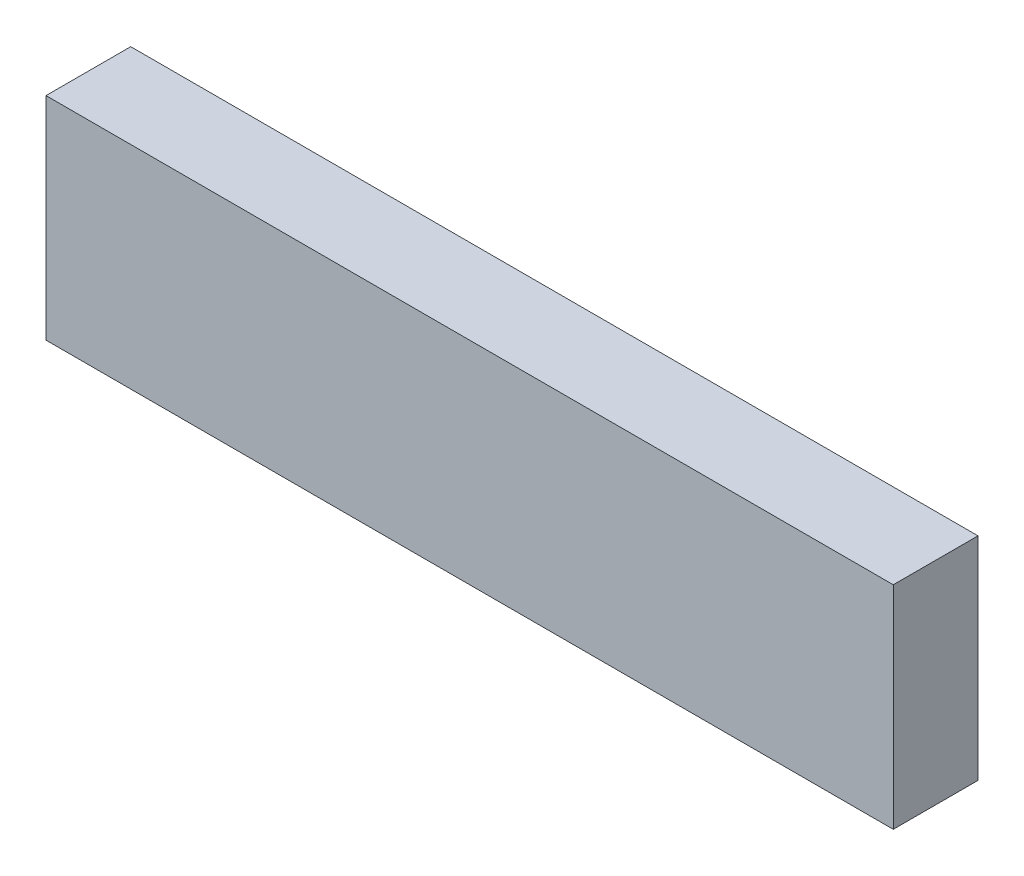
ISO-10303-21;
HEADER;
FILE_DESCRIPTION(('STEP AP214'),'2;1');
FILE_NAME('part.step','',(''),(''),'','','');
FILE_SCHEMA(('AUTOMOTIVE_DESIGN { 1 0 10303 214 1 1 1 1 }'));
ENDSEC;
DATA;
#1=APPLICATION_CONTEXT('core data for automotive mechanical design processes');
#2=APPLICATION_PROTOCOL_DEFINITION('international standard','automotive_design',2000,#1);
#3=PRODUCT_CONTEXT('',#1,'mechanical');
#4=PRODUCT('Part','Part','',(#3));
#5=PRODUCT_RELATED_PRODUCT_CATEGORY('part','',(#4));
#6=PRODUCT_DEFINITION_FORMATION('','',#4);
#7=PRODUCT_DEFINITION_CONTEXT('part definition',#1,'design');
#8=PRODUCT_DEFINITION('design','',#6,#7);
#9=PRODUCT_DEFINITION_SHAPE('','',#8);
#10=(LENGTH_UNIT() NAMED_UNIT(*) SI_UNIT(.MILLI.,.METRE.));
#11=(NAMED_UNIT(*) PLANE_ANGLE_UNIT() SI_UNIT($,.RADIAN.));
#12=(NAMED_UNIT(*) SI_UNIT($,.STERADIAN.) SOLID_ANGLE_UNIT());
#13=UNCERTAINTY_MEASURE_WITH_UNIT(LENGTH_MEASURE(1.E-05),#10,'distance_accuracy_value','');
#14=(GEOMETRIC_REPRESENTATION_CONTEXT(3) GLOBAL_UNCERTAINTY_ASSIGNED_CONTEXT((#13)) GLOBAL_UNIT_ASSIGNED_CONTEXT((#10,
#11,#12)) REPRESENTATION_CONTEXT('',''));
#15=CARTESIAN_POINT('',(0.,0.,0.));
#16=DIRECTION('',(0.,0.,1.));
#17=DIRECTION('',(1.,0.,0.));
#18=AXIS2_PLACEMENT_3D('',#15,#16,#17);
#19=CARTESIAN_POINT('',(-210.,46.99,55.8));
#20=DIRECTION('',(0.,0.,-1.));
#21=DIRECTION('',(-1.,0.,0.));
#22=AXIS2_PLACEMENT_3D('',#19,#20,#21);
#23=PLANE('',#22);
#24=DIRECTION('',(0.,1.,0.));
#25=VECTOR('',#24,1.);
#26=CARTESIAN_POINT('',(-198.,46.99,55.8));
#27=LINE('',#26,#25);
#28=CARTESIAN_POINT('',(-198.,47.,55.8));
#29=VERTEX_POINT('',#28);
#30=CARTESIAN_POINT('',(-198.,50.,55.8));
#31=VERTEX_POINT('',#30);
#32=EDGE_CURVE('E11',#29,#31,#27,.T.);
#33=ORIENTED_EDGE('',*,*,#32,.F.);
#34=DIRECTION('',(-1.,0.,0.));
#35=VECTOR('',#34,1.);
#36=CARTESIAN_POINT('',(300.,47.,55.8));
#37=LINE('',#36,#35);
#38=CARTESIAN_POINT('',(-210.,47.,55.8));
#39=VERTEX_POINT('',#38);
#40=EDGE_CURVE('E96',#29,#39,#37,.T.);
#41=ORIENTED_EDGE('',*,*,#40,.T.);
#42=DIRECTION('',(0.,1.,0.));
#43=VECTOR('',#42,1.);
#44=CARTESIAN_POINT('',(-210.,46.99,55.8));
#45=LINE('',#44,#43);
#46=CARTESIAN_POINT('',(-210.,50.,55.8));
#47=VERTEX_POINT('',#46);
#48=EDGE_CURVE('E43',#39,#47,#45,.T.);
#49=ORIENTED_EDGE('',*,*,#48,.T.);
#50=DIRECTION('',(1.,0.,0.));
#51=VECTOR('',#50,1.);
#52=CARTESIAN_POINT('',(-300.,50.,55.8));
#53=LINE('',#52,#51);
#54=EDGE_CURVE('E92',#47,#31,#53,.T.);
#55=ORIENTED_EDGE('',*,*,#54,.T.);
#56=EDGE_LOOP('',(#33,#41,#49,#55));
#57=FACE_BOUND('',#56,.T.);
#58=ADVANCED_FACE('F35',(#57),#23,.T.);
#59=CARTESIAN_POINT('',(-198.,46.99,55.8));
#60=DIRECTION('',(1.,0.,0.));
#61=DIRECTION('',(0.,0.,-1.));
#62=AXIS2_PLACEMENT_3D('',#59,#60,#61);
#63=PLANE('',#62);
#64=DIRECTION('',(0.,1.,0.));
#65=VECTOR('',#64,1.);
#66=CARTESIAN_POINT('',(-198.,46.99,57.));
#67=LINE('',#66,#65);
#68=CARTESIAN_POINT('',(-198.,47.,57.));
#69=VERTEX_POINT('',#68);
#70=CARTESIAN_POINT('',(-198.,50.,57.));
#71=VERTEX_POINT('',#70);
#72=EDGE_CURVE('E81',#69,#71,#67,.T.);
#73=ORIENTED_EDGE('',*,*,#72,.F.);
#74=DIRECTION('',(0.,0.,-1.));
#75=VECTOR('',#74,1.);
#76=CARTESIAN_POINT('',(-198.,47.,3.));
#77=LINE('',#76,#75);
#78=EDGE_CURVE('E100',#69,#29,#77,.T.);
#79=ORIENTED_EDGE('',*,*,#78,.T.);
#80=ORIENTED_EDGE('',*,*,#32,.T.);
#81=DIRECTION('',(0.,0.,1.));
#82=VECTOR('',#81,1.);
#83=CARTESIAN_POINT('',(-198.,50.,60.));
#84=LINE('',#83,#82);
#85=EDGE_CURVE('E89',#31,#71,#84,.T.);
#86=ORIENTED_EDGE('',*,*,#85,.T.);
#87=EDGE_LOOP('',(#73,#79,#80,#86));
#88=FACE_BOUND('',#87,.T.);
#89=ADVANCED_FACE('F109',(#88),#63,.T.);
#90=CARTESIAN_POINT('',(-210.,46.99,55.8));
#91=DIRECTION('',(-1.,0.,0.));
#92=DIRECTION('',(0.,0.,1.));
#93=AXIS2_PLACEMENT_3D('',#90,#91,#92);
#94=PLANE('',#93);
#95=ORIENTED_EDGE('',*,*,#48,.F.);
#96=DIRECTION('',(0.,0.,1.));
#97=VECTOR('',#96,1.);
#98=CARTESIAN_POINT('',(-210.,47.,3.));
#99=LINE('',#98,#97);
#100=CARTESIAN_POINT('',(-210.,47.,57.));
#101=VERTEX_POINT('',#100);
#102=EDGE_CURVE('E77',#39,#101,#99,.T.);
#103=ORIENTED_EDGE('',*,*,#102,.T.);
#104=DIRECTION('',(0.,1.,0.));
#105=VECTOR('',#104,1.);
#106=CARTESIAN_POINT('',(-210.,46.99,57.));
#107=LINE('',#106,#105);
#108=CARTESIAN_POINT('',(-210.,50.,57.));
#109=VERTEX_POINT('',#108);
#110=EDGE_CURVE('E71',#101,#109,#107,.T.);
#111=ORIENTED_EDGE('',*,*,#110,.T.);
#112=DIRECTION('',(0.,0.,-1.));
#113=VECTOR('',#112,1.);
#114=CARTESIAN_POINT('',(-210.,50.,60.));
#115=LINE('',#114,#113);
#116=EDGE_CURVE('E75',#109,#47,#115,.T.);
#117=ORIENTED_EDGE('',*,*,#116,.T.);
#118=EDGE_LOOP('',(#95,#103,#111,#117));
#119=FACE_BOUND('',#118,.T.);
#120=ADVANCED_FACE('F73',(#119),#94,.T.);
#121=CARTESIAN_POINT('',(-210.,46.99,57.));
#122=DIRECTION('',(0.,0.,1.));
#123=DIRECTION('',(1.,0.,0.));
#124=AXIS2_PLACEMENT_3D('',#121,#122,#123);
#125=PLANE('',#124);
#126=ORIENTED_EDGE('',*,*,#110,.F.);
#127=DIRECTION('',(1.,0.,0.));
#128=VECTOR('',#127,1.);
#129=CARTESIAN_POINT('',(300.,47.,57.));
#130=LINE('',#129,#128);
#131=EDGE_CURVE('E103',#101,#69,#130,.T.);
#132=ORIENTED_EDGE('',*,*,#131,.T.);
#133=ORIENTED_EDGE('',*,*,#72,.T.);
#134=DIRECTION('',(-1.,0.,0.));
#135=VECTOR('',#134,1.);
#136=CARTESIAN_POINT('',(-300.,50.,57.));
#137=LINE('',#136,#135);
#138=EDGE_CURVE('E84',#71,#109,#137,.T.);
#139=ORIENTED_EDGE('',*,*,#138,.T.);
#140=EDGE_LOOP('',(#126,#132,#133,#139));
#141=FACE_BOUND('',#140,.T.);
#142=ADVANCED_FACE('F85',(#141),#125,.T.);
#143=CARTESIAN_POINT('',(300.,47.,3.));
#144=DIRECTION('',(0.,1.,0.));
#145=DIRECTION('',(0.,0.,1.));
#146=AXIS2_PLACEMENT_3D('',#143,#144,#145);
#147=PLANE('',#146);
#148=ORIENTED_EDGE('',*,*,#102,.F.);
#149=ORIENTED_EDGE('',*,*,#40,.F.);
#150=ORIENTED_EDGE('',*,*,#78,.F.);
#151=ORIENTED_EDGE('',*,*,#131,.F.);
#152=EDGE_LOOP('',(#148,#149,#150,#151));
#153=FACE_BOUND('',#152,.T.);
#154=ADVANCED_FACE('F102',(#153),#147,.F.);
#155=CARTESIAN_POINT('',(-300.,50.,60.));
#156=DIRECTION('',(0.,-1.,0.));
#157=DIRECTION('',(0.,0.,-1.));
#158=AXIS2_PLACEMENT_3D('',#155,#156,#157);
#159=PLANE('',#158);
#160=ORIENTED_EDGE('',*,*,#116,.F.);
#161=ORIENTED_EDGE('',*,*,#138,.F.);
#162=ORIENTED_EDGE('',*,*,#85,.F.);
#163=ORIENTED_EDGE('',*,*,#54,.F.);
#164=EDGE_LOOP('',(#160,#161,#162,#163));
#165=FACE_BOUND('',#164,.T.);
#166=ADVANCED_FACE('F37',(#165),#159,.F.);
#167=CLOSED_SHELL('',(#58,#89,#120,#142,#154,#166));
#168=MANIFOLD_SOLID_BREP('B2',#167);
#169=ADVANCED_BREP_SHAPE_REPRESENTATION('',(#18,#168),#14);
#170=SHAPE_DEFINITION_REPRESENTATION(#9,#169);
ENDSEC;
END-ISO-10303-21;
